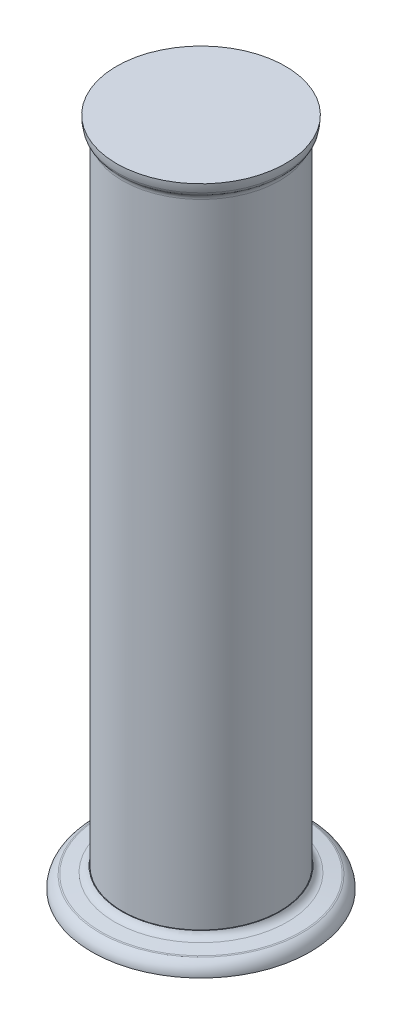
ISO-10303-21;
HEADER;
FILE_DESCRIPTION(('STEP AP214'),'2;1');
FILE_NAME('part.step','',(''),(''),'','','');
FILE_SCHEMA(('AUTOMOTIVE_DESIGN { 1 0 10303 214 1 1 1 1 }'));
ENDSEC;
DATA;
#1=APPLICATION_CONTEXT('core data for automotive mechanical design processes');
#2=APPLICATION_PROTOCOL_DEFINITION('international standard','automotive_design',2000,#1);
#3=PRODUCT_CONTEXT('',#1,'mechanical');
#4=PRODUCT('Part','Part','',(#3));
#5=PRODUCT_RELATED_PRODUCT_CATEGORY('part','',(#4));
#6=PRODUCT_DEFINITION_FORMATION('','',#4);
#7=PRODUCT_DEFINITION_CONTEXT('part definition',#1,'design');
#8=PRODUCT_DEFINITION('design','',#6,#7);
#9=PRODUCT_DEFINITION_SHAPE('','',#8);
#10=(LENGTH_UNIT() NAMED_UNIT(*) SI_UNIT(.MILLI.,.METRE.));
#11=(NAMED_UNIT(*) PLANE_ANGLE_UNIT() SI_UNIT($,.RADIAN.));
#12=(NAMED_UNIT(*) SI_UNIT($,.STERADIAN.) SOLID_ANGLE_UNIT());
#13=UNCERTAINTY_MEASURE_WITH_UNIT(LENGTH_MEASURE(1.E-05),#10,'distance_accuracy_value','');
#14=(GEOMETRIC_REPRESENTATION_CONTEXT(3) GLOBAL_UNCERTAINTY_ASSIGNED_CONTEXT((#13)) GLOBAL_UNIT_ASSIGNED_CONTEXT((#10,
#11,#12)) REPRESENTATION_CONTEXT('',''));
#15=CARTESIAN_POINT('',(0.,0.,0.));
#16=DIRECTION('',(0.,0.,1.));
#17=DIRECTION('',(1.,0.,0.));
#18=AXIS2_PLACEMENT_3D('',#15,#16,#17);
#19=CARTESIAN_POINT('',(-3.29577813896613E-12,213.800000000003,-251.000000000001));
#20=DIRECTION('',(0.,-1.,0.));
#21=DIRECTION('',(0.,0.,-1.));
#22=AXIS2_PLACEMENT_3D('',#19,#20,#21);
#23=PLANE('',#22);
#24=CARTESIAN_POINT('',(-3.29766225910432E-12,213.800000000003,-176.000000000001));
#25=DIRECTION('',(0.,1.,0.));
#26=DIRECTION('',(0.,0.,1.));
#27=AXIS2_PLACEMENT_3D('',#24,#25,#26);
#28=CIRCLE('',#27,75.);
#29=CARTESIAN_POINT('',(-3.29766225910432E-12,213.800000000003,-101.000000000001));
#30=VERTEX_POINT('',#29);
#31=EDGE_CURVE('E35',#30,#30,#28,.T.);
#32=ORIENTED_EDGE('',*,*,#31,.F.);
#33=EDGE_LOOP('',(#32));
#34=FACE_BOUND('',#33,.T.);
#35=ADVANCED_FACE('F32',(#34),#23,.T.);
#36=CARTESIAN_POINT('',(-3.29766225910432E-12,213.800000000003,-176.000000000001));
#37=DIRECTION('',(0.,1.,0.));
#38=DIRECTION('',(0.,0.,1.));
#39=AXIS2_PLACEMENT_3D('',#36,#37,#38);
#40=TOROIDAL_SURFACE('',#39,65.5989529684485,9.40104703155155);
#41=CARTESIAN_POINT('',(-3.29781962002054E-12,222.366147078511,-176.000000000001));
#42=DIRECTION('',(0.,1.,0.));
#43=DIRECTION('',(0.,0.,1.));
#44=AXIS2_PLACEMENT_3D('',#41,#42,#43);
#45=CIRCLE('',#44,69.4720408216769);
#46=CARTESIAN_POINT('',(-3.29781962002054E-12,222.366147078511,-106.527959178324));
#47=VERTEX_POINT('',#46);
#48=EDGE_CURVE('E81',#47,#47,#45,.T.);
#49=ORIENTED_EDGE('',*,*,#48,.F.);
#50=EDGE_LOOP('',(#49));
#51=FACE_BOUND('',#50,.T.);
#52=ORIENTED_EDGE('',*,*,#31,.T.);
#53=EDGE_LOOP('',(#52));
#54=FACE_BOUND('',#53,.T.);
#55=ADVANCED_FACE('F90',(#51,#54),#40,.T.);
#56=CARTESIAN_POINT('',(-3.29781962002054E-12,219.780358568721,-176.000000000001));
#57=DIRECTION('',(0.,1.,0.));
#58=DIRECTION('',(0.,0.,1.));
#59=AXIS2_PLACEMENT_3D('',#56,#57,#58);
#60=TOROIDAL_SURFACE('',#59,68.3029053893175,2.83781251610467);
#61=CARTESIAN_POINT('',(-3.30202314347965E-12,222.59701846066,-176.000000000001));
#62=DIRECTION('',(0.,-1.,0.));
#63=DIRECTION('',(0.,0.,1.));
#64=AXIS2_PLACEMENT_3D('',#61,#62,#63);
#65=CIRCLE('',#64,68.6487477373621);
#66=CARTESIAN_POINT('',(-3.30773930000587E-12,222.59701846066,-107.351252262639));
#67=VERTEX_POINT('',#66);
#68=EDGE_CURVE('E78',#67,#67,#65,.F.);
#69=ORIENTED_EDGE('',*,*,#68,.F.);
#70=EDGE_LOOP('',(#69));
#71=FACE_BOUND('',#70,.T.);
#72=ORIENTED_EDGE('',*,*,#48,.T.);
#73=EDGE_LOOP('',(#72));
#74=FACE_BOUND('',#73,.T.);
#75=ADVANCED_FACE('F86',(#71,#74),#60,.T.);
#76=CARTESIAN_POINT('',(-3.29719371126791E-12,674.400000000003,-233.999544291101));
#77=DIRECTION('',(0.,1.,0.));
#78=DIRECTION('',(0.,0.,1.));
#79=AXIS2_PLACEMENT_3D('',#76,#77,#78);
#80=PLANE('',#79);
#81=CARTESIAN_POINT('',(-3.29847169566624E-12,674.400000000003,-176.000000000001));
#82=DIRECTION('',(0.,1.,0.));
#83=DIRECTION('',(0.,0.,1.));
#84=AXIS2_PLACEMENT_3D('',#81,#82,#83);
#85=CIRCLE('',#84,57.9995442910995);
#86=CARTESIAN_POINT('',(-3.29847169566624E-12,674.400000000003,-118.000455708902));
#87=VERTEX_POINT('',#86);
#88=EDGE_CURVE('E75',#87,#87,#85,.F.);
#89=ORIENTED_EDGE('',*,*,#88,.F.);
#90=EDGE_LOOP('',(#89));
#91=FACE_BOUND('',#90,.T.);
#92=ADVANCED_FACE('F89',(#91),#80,.T.);
#93=CARTESIAN_POINT('',(-3.30202314347965E-12,222.59701846066,-176.000000000001));
#94=DIRECTION('',(0.,-1.,0.));
#95=DIRECTION('',(0.,0.,-1.));
#96=AXIS2_PLACEMENT_3D('',#93,#94,#95);
#97=CONICAL_SURFACE('',#96,68.6487477373623,1.4486232791553);
#98=ORIENTED_EDGE('',*,*,#68,.T.);
#99=EDGE_LOOP('',(#98));
#100=FACE_BOUND('',#99,.T.);
#101=CARTESIAN_POINT('',(-3.30565230980669E-12,223.748733196857,-176.000000000001));
#102=DIRECTION('',(0.,1.,0.));
#103=DIRECTION('',(0.,0.,1.));
#104=AXIS2_PLACEMENT_3D('',#101,#102,#103);
#105=CIRCLE('',#104,59.2687839395692);
#106=CARTESIAN_POINT('',(-3.30565230980669E-12,223.748733196857,-116.731216060432));
#107=VERTEX_POINT('',#106);
#108=EDGE_CURVE('E73',#107,#107,#105,.F.);
#109=ORIENTED_EDGE('',*,*,#108,.T.);
#110=EDGE_LOOP('',(#109));
#111=FACE_BOUND('',#110,.T.);
#112=ADVANCED_FACE('F106',(#100,#111),#97,.T.);
#113=CARTESIAN_POINT('',(-3.29847169566624E-12,674.548999036331,-176.000000000001));
#114=DIRECTION('',(0.,1.,0.));
#115=DIRECTION('',(0.,0.,1.));
#116=AXIS2_PLACEMENT_3D('',#113,#114,#115);
#117=TOROIDAL_SURFACE('',#116,33.642434735737,24.3575652848301);
#118=ORIENTED_EDGE('',*,*,#88,.T.);
#119=EDGE_LOOP('',(#118));
#120=FACE_BOUND('',#119,.T.);
#121=CARTESIAN_POINT('',(-3.29851886267183E-12,668.470084925447,-176.000000000001));
#122=DIRECTION('',(0.,1.,0.));
#123=DIRECTION('',(0.,0.,1.));
#124=AXIS2_PLACEMENT_3D('',#121,#122,#123);
#125=CIRCLE('',#124,57.2292486332781);
#126=CARTESIAN_POINT('',(-3.29851886267183E-12,668.470084925447,-118.770751366723));
#127=VERTEX_POINT('',#126);
#128=EDGE_CURVE('E52',#127,#127,#125,.F.);
#129=ORIENTED_EDGE('',*,*,#128,.F.);
#130=EDGE_LOOP('',(#129));
#131=FACE_BOUND('',#130,.T.);
#132=ADVANCED_FACE('F66',(#120,#131),#117,.T.);
#133=CARTESIAN_POINT('',(-3.30547800626991E-12,229.704010106705,-176.000000000001));
#134=DIRECTION('',(0.,1.,0.));
#135=DIRECTION('',(0.,0.,1.));
#136=AXIS2_PLACEMENT_3D('',#133,#134,#135);
#137=TOROIDAL_SURFACE('',#136,60.,6.00000000000001);
#138=ORIENTED_EDGE('',*,*,#108,.F.);
#139=EDGE_LOOP('',(#138));
#140=FACE_BOUND('',#139,.T.);
#141=CARTESIAN_POINT('',(-3.3055410530962E-12,227.549944183851,-176.000000000001));
#142=DIRECTION('',(0.,1.,0.));
#143=DIRECTION('',(0.,0.,1.));
#144=AXIS2_PLACEMENT_3D('',#141,#142,#143);
#145=CIRCLE('',#144,54.4);
#146=CARTESIAN_POINT('',(-3.3055410530962E-12,227.549944183851,-121.600000000001));
#147=VERTEX_POINT('',#146);
#148=EDGE_CURVE('E98',#147,#147,#145,.T.);
#149=ORIENTED_EDGE('',*,*,#148,.F.);
#150=EDGE_LOOP('',(#149));
#151=FACE_BOUND('',#150,.T.);
#152=ADVANCED_FACE('F60',(#140,#151),#137,.F.);
#153=CARTESIAN_POINT('',(-3.29851886267183E-12,669.71793421576,-176.000000000001));
#154=DIRECTION('',(0.,1.,0.));
#155=DIRECTION('',(0.,0.,1.));
#156=AXIS2_PLACEMENT_3D('',#153,#154,#155);
#157=TOROIDAL_SURFACE('',#156,52.3874646491793,5.00000000000109);
#158=ORIENTED_EDGE('',*,*,#128,.T.);
#159=EDGE_LOOP('',(#158));
#160=FACE_BOUND('',#159,.T.);
#161=CARTESIAN_POINT('',(-3.30328899422403E-12,666.220594287331,-176.000000000001));
#162=DIRECTION('',(0.,1.,0.));
#163=DIRECTION('',(-1.,0.,0.));
#164=AXIS2_PLACEMENT_3D('',#161,#162,#163);
#165=CIRCLE('',#164,55.9607843137254);
#166=CARTESIAN_POINT('',(-55.9607843137287,666.220594287331,-176.000000000001));
#167=VERTEX_POINT('',#166);
#168=EDGE_CURVE('E44',#167,#167,#165,.T.);
#169=ORIENTED_EDGE('',*,*,#168,.T.);
#170=EDGE_LOOP('',(#169));
#171=FACE_BOUND('',#170,.T.);
#172=ADVANCED_FACE('F55',(#160,#171),#157,.T.);
#173=CARTESIAN_POINT('',(-3.29749343353917E-12,227.549944183851,-230.400000000001));
#174=DIRECTION('',(0.,1.,0.));
#175=DIRECTION('',(0.,0.,1.));
#176=AXIS2_PLACEMENT_3D('',#173,#174,#175);
#177=PLANE('',#176);
#178=CARTESIAN_POINT('',(-3.30202314347965E-12,227.549944183851,-176.000000000001));
#179=DIRECTION('',(0.,-1.,0.));
#180=DIRECTION('',(0.,0.,-1.));
#181=AXIS2_PLACEMENT_3D('',#178,#179,#180);
#182=CIRCLE('',#181,54.);
#183=CARTESIAN_POINT('',(-3.30202314347965E-12,227.549944183851,-230.000000000001));
#184=VERTEX_POINT('',#183);
#185=EDGE_CURVE('E39',#184,#184,#182,.F.);
#186=ORIENTED_EDGE('',*,*,#185,.F.);
#187=EDGE_LOOP('',(#186));
#188=FACE_BOUND('',#187,.T.);
#189=ORIENTED_EDGE('',*,*,#148,.T.);
#190=EDGE_LOOP('',(#189));
#191=FACE_BOUND('',#190,.T.);
#192=ADVANCED_FACE('F59',(#188,#191),#177,.T.);
#193=CARTESIAN_POINT('',(-3.30532968983734E-12,662.25030865374,-176.000000000001));
#194=DIRECTION('',(0.,1.,0.));
#195=DIRECTION('',(-1.,0.,0.));
#196=AXIS2_PLACEMENT_3D('',#193,#194,#195);
#197=TOROIDAL_SURFACE('',#196,59.0000000000003,5.00000000000024);
#198=CARTESIAN_POINT('',(-3.30202314347965E-12,662.25030865374,-176.000000000001));
#199=DIRECTION('',(0.,-1.,0.));
#200=DIRECTION('',(0.,0.,-1.));
#201=AXIS2_PLACEMENT_3D('',#198,#199,#200);
#202=CIRCLE('',#201,54.);
#203=CARTESIAN_POINT('',(-3.30202314347965E-12,662.25030865374,-230.000000000001));
#204=VERTEX_POINT('',#203);
#205=EDGE_CURVE('E10',#204,#204,#202,.T.);
#206=ORIENTED_EDGE('',*,*,#205,.F.);
#207=EDGE_LOOP('',(#206));
#208=FACE_BOUND('',#207,.T.);
#209=ORIENTED_EDGE('',*,*,#168,.F.);
#210=EDGE_LOOP('',(#209));
#211=FACE_BOUND('',#210,.T.);
#212=ADVANCED_FACE('F113',(#208,#211),#197,.F.);
#213=CARTESIAN_POINT('',(-3.30202314347965E-12,213.800000000003,-176.000000000001));
#214=DIRECTION('',(0.,-1.,0.));
#215=DIRECTION('',(0.,0.,-1.));
#216=AXIS2_PLACEMENT_3D('',#213,#214,#215);
#217=CYLINDRICAL_SURFACE('',#216,54.);
#218=ORIENTED_EDGE('',*,*,#185,.T.);
#219=EDGE_LOOP('',(#218));
#220=FACE_BOUND('',#219,.T.);
#221=ORIENTED_EDGE('',*,*,#205,.T.);
#222=EDGE_LOOP('',(#221));
#223=FACE_BOUND('',#222,.T.);
#224=ADVANCED_FACE('F111',(#220,#223),#217,.T.);
#225=CLOSED_SHELL('',(#35,#55,#75,#92,#112,#132,#152,#172,#192,#212,#224));
#226=MANIFOLD_SOLID_BREP('B2',#225);
#227=ADVANCED_BREP_SHAPE_REPRESENTATION('',(#18,#226),#14);
#228=SHAPE_DEFINITION_REPRESENTATION(#9,#227);
ENDSEC;
END-ISO-10303-21;
